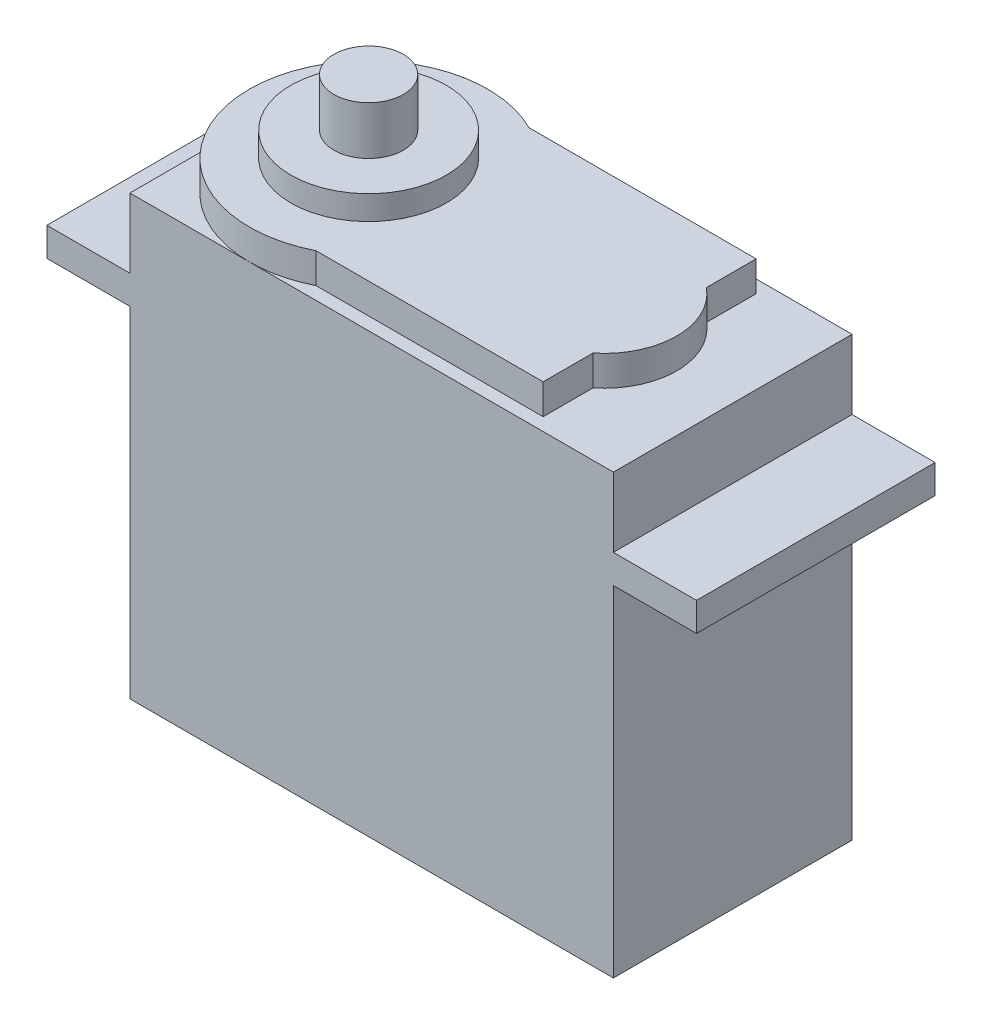
ISO-10303-21;
HEADER;
FILE_DESCRIPTION(('STEP AP214'),'2;1');
FILE_NAME('part.step','',(''),(''),'','','');
FILE_SCHEMA(('AUTOMOTIVE_DESIGN { 1 0 10303 214 1 1 1 1 }'));
ENDSEC;
DATA;
#1=APPLICATION_CONTEXT('core data for automotive mechanical design processes');
#2=APPLICATION_PROTOCOL_DEFINITION('international standard','automotive_design',2000,#1);
#3=PRODUCT_CONTEXT('',#1,'mechanical');
#4=PRODUCT('Part','Part','',(#3));
#5=PRODUCT_RELATED_PRODUCT_CATEGORY('part','',(#4));
#6=PRODUCT_DEFINITION_FORMATION('','',#4);
#7=PRODUCT_DEFINITION_CONTEXT('part definition',#1,'design');
#8=PRODUCT_DEFINITION('design','',#6,#7);
#9=PRODUCT_DEFINITION_SHAPE('','',#8);
#10=(LENGTH_UNIT() NAMED_UNIT(*) SI_UNIT(.MILLI.,.METRE.));
#11=(NAMED_UNIT(*) PLANE_ANGLE_UNIT() SI_UNIT($,.RADIAN.));
#12=(NAMED_UNIT(*) SI_UNIT($,.STERADIAN.) SOLID_ANGLE_UNIT());
#13=UNCERTAINTY_MEASURE_WITH_UNIT(LENGTH_MEASURE(1.E-05),#10,'distance_accuracy_value','');
#14=(GEOMETRIC_REPRESENTATION_CONTEXT(3) GLOBAL_UNCERTAINTY_ASSIGNED_CONTEXT((#13)) GLOBAL_UNIT_ASSIGNED_CONTEXT((#10,
#11,#12)) REPRESENTATION_CONTEXT('',''));
#15=CARTESIAN_POINT('',(0.,0.,0.));
#16=DIRECTION('',(0.,0.,1.));
#17=DIRECTION('',(1.,0.,0.));
#18=AXIS2_PLACEMENT_3D('',#15,#16,#17);
#19=CARTESIAN_POINT('',(0.,36.83,20.066));
#20=DIRECTION('',(0.,-1.,0.));
#21=DIRECTION('',(0.,0.,-1.));
#22=AXIS2_PLACEMENT_3D('',#19,#20,#21);
#23=PLANE('',#22);
#24=CARTESIAN_POINT('',(10.033,36.83,10.033));
#25=DIRECTION('',(0.,1.,0.));
#26=DIRECTION('',(0.,0.,1.));
#27=AXIS2_PLACEMENT_3D('',#24,#25,#26);
#28=CIRCLE('',#27,10.033);
#29=CARTESIAN_POINT('',(14.5602427315089,36.83,1.07950000000001));
#30=VERTEX_POINT('',#29);
#31=CARTESIAN_POINT('',(10.033,36.83,0.));
#32=VERTEX_POINT('',#31);
#33=EDGE_CURVE('E61',#30,#32,#28,.T.);
#34=ORIENTED_EDGE('',*,*,#33,.F.);
#35=DIRECTION('',(-1.,0.,0.));
#36=VECTOR('',#35,1.);
#37=CARTESIAN_POINT('',(14.5602427315089,36.83,1.07950000000001));
#38=LINE('',#37,#36);
#39=CARTESIAN_POINT('',(33.655,36.83,1.07950000000001));
#40=VERTEX_POINT('',#39);
#41=EDGE_CURVE('E65',#40,#30,#38,.T.);
#42=ORIENTED_EDGE('',*,*,#41,.F.);
#43=DIRECTION('',(0.,0.,-1.));
#44=VECTOR('',#43,1.);
#45=CARTESIAN_POINT('',(33.655,36.83,1.07950000000001));
#46=LINE('',#45,#44);
#47=CARTESIAN_POINT('',(33.655,36.83,5.2705));
#48=VERTEX_POINT('',#47);
#49=EDGE_CURVE('E401',#48,#40,#46,.T.);
#50=ORIENTED_EDGE('',*,*,#49,.F.);
#51=CARTESIAN_POINT('',(29.8370625,36.83,10.033));
#52=DIRECTION('',(0.,1.,0.));
#53=DIRECTION('',(0.,0.,-1.));
#54=AXIS2_PLACEMENT_3D('',#51,#52,#53);
#55=CIRCLE('',#54,6.10393750000001);
#56=CARTESIAN_POINT('',(33.655,36.83,14.7955));
#57=VERTEX_POINT('',#56);
#58=EDGE_CURVE('E394',#57,#48,#55,.T.);
#59=ORIENTED_EDGE('',*,*,#58,.F.);
#60=DIRECTION('',(0.,0.,-1.));
#61=VECTOR('',#60,1.);
#62=CARTESIAN_POINT('',(33.655,36.83,14.7955));
#63=LINE('',#62,#61);
#64=CARTESIAN_POINT('',(33.655,36.83,18.9865));
#65=VERTEX_POINT('',#64);
#66=EDGE_CURVE('E354',#65,#57,#63,.T.);
#67=ORIENTED_EDGE('',*,*,#66,.F.);
#68=DIRECTION('',(1.,0.,0.));
#69=VECTOR('',#68,1.);
#70=CARTESIAN_POINT('',(14.5602427315089,36.83,18.9865));
#71=LINE('',#70,#69);
#72=CARTESIAN_POINT('',(14.5602427315089,36.83,18.9865));
#73=VERTEX_POINT('',#72);
#74=EDGE_CURVE('E349',#73,#65,#71,.T.);
#75=ORIENTED_EDGE('',*,*,#74,.F.);
#76=CARTESIAN_POINT('',(10.033,36.83,20.066));
#77=VERTEX_POINT('',#76);
#78=EDGE_CURVE('E205',#77,#73,#28,.T.);
#79=ORIENTED_EDGE('',*,*,#78,.F.);
#80=DIRECTION('',(-1.,0.,0.));
#81=VECTOR('',#80,1.);
#82=CARTESIAN_POINT('',(0.,36.83,20.066));
#83=LINE('',#82,#81);
#84=CARTESIAN_POINT('',(40.64,36.83,20.066));
#85=VERTEX_POINT('',#84);
#86=EDGE_CURVE('E242',#85,#77,#83,.T.);
#87=ORIENTED_EDGE('',*,*,#86,.F.);
#88=DIRECTION('',(0.,0.,-1.));
#89=VECTOR('',#88,1.);
#90=CARTESIAN_POINT('',(40.64,36.83,20.066));
#91=LINE('',#90,#89);
#92=CARTESIAN_POINT('',(40.64,36.83,0.));
#93=VERTEX_POINT('',#92);
#94=EDGE_CURVE('E311',#85,#93,#91,.T.);
#95=ORIENTED_EDGE('',*,*,#94,.T.);
#96=DIRECTION('',(-1.,0.,0.));
#97=VECTOR('',#96,1.);
#98=CARTESIAN_POINT('',(0.,36.83,0.));
#99=LINE('',#98,#97);
#100=EDGE_CURVE('E277',#93,#32,#99,.T.);
#101=ORIENTED_EDGE('',*,*,#100,.T.);
#102=EDGE_LOOP('',(#34,#42,#50,#59,#67,#75,#79,#87,#95,#101));
#103=FACE_BOUND('',#102,.T.);
#104=ADVANCED_FACE('F43',(#103),#23,.F.);
#105=CARTESIAN_POINT('',(0.,36.83,10.033));
#106=VERTEX_POINT('',#105);
#107=EDGE_CURVE('E345',#32,#106,#28,.T.);
#108=ORIENTED_EDGE('',*,*,#107,.F.);
#109=CARTESIAN_POINT('',(0.,36.83,0.));
#110=VERTEX_POINT('',#109);
#111=EDGE_CURVE('E276',#32,#110,#99,.T.);
#112=ORIENTED_EDGE('',*,*,#111,.T.);
#113=DIRECTION('',(0.,0.,-1.));
#114=VECTOR('',#113,1.);
#115=CARTESIAN_POINT('',(0.,36.83,20.066));
#116=LINE('',#115,#114);
#117=EDGE_CURVE('E306',#106,#110,#116,.T.);
#118=ORIENTED_EDGE('',*,*,#117,.F.);
#119=EDGE_LOOP('',(#108,#112,#118));
#120=FACE_BOUND('',#119,.T.);
#121=ADVANCED_FACE('F420',(#120),#23,.F.);
#122=EDGE_CURVE('E342',#106,#77,#28,.T.);
#123=ORIENTED_EDGE('',*,*,#122,.F.);
#124=CARTESIAN_POINT('',(0.,36.83,20.066));
#125=VERTEX_POINT('',#124);
#126=EDGE_CURVE('E307',#125,#106,#116,.T.);
#127=ORIENTED_EDGE('',*,*,#126,.F.);
#128=EDGE_CURVE('E241',#77,#125,#83,.T.);
#129=ORIENTED_EDGE('',*,*,#128,.F.);
#130=EDGE_LOOP('',(#123,#127,#129));
#131=FACE_BOUND('',#130,.T.);
#132=ADVANCED_FACE('F422',(#131),#23,.F.);
#133=CARTESIAN_POINT('',(0.,0.,20.066));
#134=DIRECTION('',(1.,0.,0.));
#135=DIRECTION('',(0.,0.,-1.));
#136=AXIS2_PLACEMENT_3D('',#133,#134,#135);
#137=PLANE('',#136);
#138=DIRECTION('',(0.,-1.,0.));
#139=VECTOR('',#138,1.);
#140=CARTESIAN_POINT('',(0.,0.,0.));
#141=LINE('',#140,#139);
#142=CARTESIAN_POINT('',(0.,28.575,0.));
#143=VERTEX_POINT('',#142);
#144=CARTESIAN_POINT('',(0.,0.,0.));
#145=VERTEX_POINT('',#144);
#146=EDGE_CURVE('E207',#143,#145,#141,.T.);
#147=ORIENTED_EDGE('',*,*,#146,.T.);
#148=DIRECTION('',(0.,0.,-1.));
#149=VECTOR('',#148,1.);
#150=CARTESIAN_POINT('',(0.,0.,20.066));
#151=LINE('',#150,#149);
#152=CARTESIAN_POINT('',(0.,0.,20.066));
#153=VERTEX_POINT('',#152);
#154=EDGE_CURVE('E47',#153,#145,#151,.T.);
#155=ORIENTED_EDGE('',*,*,#154,.F.);
#156=DIRECTION('',(0.,-1.,0.));
#157=VECTOR('',#156,1.);
#158=CARTESIAN_POINT('',(0.,0.,20.066));
#159=LINE('',#158,#157);
#160=CARTESIAN_POINT('',(0.,28.575,20.066));
#161=VERTEX_POINT('',#160);
#162=EDGE_CURVE('E218',#161,#153,#159,.T.);
#163=ORIENTED_EDGE('',*,*,#162,.F.);
#164=DIRECTION('',(0.,0.,-1.));
#165=VECTOR('',#164,1.);
#166=CARTESIAN_POINT('',(0.,28.575,20.066));
#167=LINE('',#166,#165);
#168=EDGE_CURVE('E257',#161,#143,#167,.T.);
#169=ORIENTED_EDGE('',*,*,#168,.T.);
#170=EDGE_LOOP('',(#147,#155,#163,#169));
#171=FACE_BOUND('',#170,.T.);
#172=ADVANCED_FACE('F45',(#171),#137,.F.);
#173=CARTESIAN_POINT('',(0.,0.,20.066));
#174=DIRECTION('',(0.,1.,0.));
#175=DIRECTION('',(0.,0.,1.));
#176=AXIS2_PLACEMENT_3D('',#173,#174,#175);
#177=PLANE('',#176);
#178=DIRECTION('',(1.,0.,0.));
#179=VECTOR('',#178,1.);
#180=CARTESIAN_POINT('',(0.,0.,0.));
#181=LINE('',#180,#179);
#182=CARTESIAN_POINT('',(40.64,0.,0.));
#183=VERTEX_POINT('',#182);
#184=EDGE_CURVE('E212',#145,#183,#181,.T.);
#185=ORIENTED_EDGE('',*,*,#184,.T.);
#186=DIRECTION('',(0.,0.,-1.));
#187=VECTOR('',#186,1.);
#188=CARTESIAN_POINT('',(40.64,0.,20.066));
#189=LINE('',#188,#187);
#190=CARTESIAN_POINT('',(40.64,0.,20.066));
#191=VERTEX_POINT('',#190);
#192=EDGE_CURVE('E330',#191,#183,#189,.T.);
#193=ORIENTED_EDGE('',*,*,#192,.F.);
#194=DIRECTION('',(1.,0.,0.));
#195=VECTOR('',#194,1.);
#196=CARTESIAN_POINT('',(0.,0.,20.066));
#197=LINE('',#196,#195);
#198=EDGE_CURVE('E222',#153,#191,#197,.T.);
#199=ORIENTED_EDGE('',*,*,#198,.F.);
#200=ORIENTED_EDGE('',*,*,#154,.T.);
#201=EDGE_LOOP('',(#185,#193,#199,#200));
#202=FACE_BOUND('',#201,.T.);
#203=ADVANCED_FACE('F434',(#202),#177,.F.);
#204=CARTESIAN_POINT('',(40.64,0.,20.066));
#205=DIRECTION('',(-1.,0.,0.));
#206=DIRECTION('',(0.,0.,1.));
#207=AXIS2_PLACEMENT_3D('',#204,#205,#206);
#208=PLANE('',#207);
#209=DIRECTION('',(0.,1.,0.));
#210=VECTOR('',#209,1.);
#211=CARTESIAN_POINT('',(40.64,0.,0.));
#212=LINE('',#211,#210);
#213=CARTESIAN_POINT('',(40.64,28.575,0.));
#214=VERTEX_POINT('',#213);
#215=EDGE_CURVE('E261',#183,#214,#212,.T.);
#216=ORIENTED_EDGE('',*,*,#215,.T.);
#217=DIRECTION('',(0.,0.,-1.));
#218=VECTOR('',#217,1.);
#219=CARTESIAN_POINT('',(40.64,28.575,20.066));
#220=LINE('',#219,#218);
#221=CARTESIAN_POINT('',(40.64,28.575,20.066));
#222=VERTEX_POINT('',#221);
#223=EDGE_CURVE('E327',#222,#214,#220,.T.);
#224=ORIENTED_EDGE('',*,*,#223,.F.);
#225=DIRECTION('',(0.,1.,0.));
#226=VECTOR('',#225,1.);
#227=CARTESIAN_POINT('',(40.64,0.,20.066));
#228=LINE('',#227,#226);
#229=EDGE_CURVE('E226',#191,#222,#228,.T.);
#230=ORIENTED_EDGE('',*,*,#229,.F.);
#231=ORIENTED_EDGE('',*,*,#192,.T.);
#232=EDGE_LOOP('',(#216,#224,#230,#231));
#233=FACE_BOUND('',#232,.T.);
#234=ADVANCED_FACE('F479',(#233),#208,.F.);
#235=CARTESIAN_POINT('',(40.64,28.575,20.066));
#236=DIRECTION('',(0.,1.,0.));
#237=DIRECTION('',(-1.,0.,0.));
#238=AXIS2_PLACEMENT_3D('',#235,#236,#237);
#239=PLANE('',#238);
#240=DIRECTION('',(1.,0.,0.));
#241=VECTOR('',#240,1.);
#242=CARTESIAN_POINT('',(40.64,28.575,0.));
#243=LINE('',#242,#241);
#244=CARTESIAN_POINT('',(47.625,28.575,0.));
#245=VERTEX_POINT('',#244);
#246=EDGE_CURVE('E264',#214,#245,#243,.T.);
#247=ORIENTED_EDGE('',*,*,#246,.T.);
#248=DIRECTION('',(0.,0.,-1.));
#249=VECTOR('',#248,1.);
#250=CARTESIAN_POINT('',(47.625,28.575,20.066));
#251=LINE('',#250,#249);
#252=CARTESIAN_POINT('',(47.625,28.575,20.066));
#253=VERTEX_POINT('',#252);
#254=EDGE_CURVE('E323',#253,#245,#251,.T.);
#255=ORIENTED_EDGE('',*,*,#254,.F.);
#256=DIRECTION('',(1.,0.,0.));
#257=VECTOR('',#256,1.);
#258=CARTESIAN_POINT('',(40.64,28.575,20.066));
#259=LINE('',#258,#257);
#260=EDGE_CURVE('E229',#222,#253,#259,.T.);
#261=ORIENTED_EDGE('',*,*,#260,.F.);
#262=ORIENTED_EDGE('',*,*,#223,.T.);
#263=EDGE_LOOP('',(#247,#255,#261,#262));
#264=FACE_BOUND('',#263,.T.);
#265=ADVANCED_FACE('F485',(#264),#239,.F.);
#266=CARTESIAN_POINT('',(47.625,30.988,20.066));
#267=DIRECTION('',(-1.,0.,0.));
#268=DIRECTION('',(0.,0.,1.));
#269=AXIS2_PLACEMENT_3D('',#266,#267,#268);
#270=PLANE('',#269);
#271=DIRECTION('',(0.,1.,0.));
#272=VECTOR('',#271,1.);
#273=CARTESIAN_POINT('',(47.625,30.988,0.));
#274=LINE('',#273,#272);
#275=CARTESIAN_POINT('',(47.625,30.988,0.));
#276=VERTEX_POINT('',#275);
#277=EDGE_CURVE('E267',#245,#276,#274,.T.);
#278=ORIENTED_EDGE('',*,*,#277,.T.);
#279=DIRECTION('',(0.,0.,-1.));
#280=VECTOR('',#279,1.);
#281=CARTESIAN_POINT('',(47.625,30.988,20.066));
#282=LINE('',#281,#280);
#283=CARTESIAN_POINT('',(47.625,30.988,20.066));
#284=VERTEX_POINT('',#283);
#285=EDGE_CURVE('E319',#284,#276,#282,.T.);
#286=ORIENTED_EDGE('',*,*,#285,.F.);
#287=DIRECTION('',(0.,1.,0.));
#288=VECTOR('',#287,1.);
#289=CARTESIAN_POINT('',(47.625,30.988,20.066));
#290=LINE('',#289,#288);
#291=EDGE_CURVE('E232',#253,#284,#290,.T.);
#292=ORIENTED_EDGE('',*,*,#291,.F.);
#293=ORIENTED_EDGE('',*,*,#254,.T.);
#294=EDGE_LOOP('',(#278,#286,#292,#293));
#295=FACE_BOUND('',#294,.T.);
#296=ADVANCED_FACE('F488',(#295),#270,.F.);
#297=CARTESIAN_POINT('',(40.64,30.988,20.066));
#298=DIRECTION('',(0.,-1.,0.));
#299=DIRECTION('',(0.,0.,-1.));
#300=AXIS2_PLACEMENT_3D('',#297,#298,#299);
#301=PLANE('',#300);
#302=DIRECTION('',(-1.,0.,0.));
#303=VECTOR('',#302,1.);
#304=CARTESIAN_POINT('',(40.64,30.988,0.));
#305=LINE('',#304,#303);
#306=CARTESIAN_POINT('',(40.64,30.988,0.));
#307=VERTEX_POINT('',#306);
#308=EDGE_CURVE('E270',#276,#307,#305,.T.);
#309=ORIENTED_EDGE('',*,*,#308,.T.);
#310=DIRECTION('',(0.,0.,-1.));
#311=VECTOR('',#310,1.);
#312=CARTESIAN_POINT('',(40.64,30.988,20.066));
#313=LINE('',#312,#311);
#314=CARTESIAN_POINT('',(40.64,30.988,20.066));
#315=VERTEX_POINT('',#314);
#316=EDGE_CURVE('E315',#315,#307,#313,.T.);
#317=ORIENTED_EDGE('',*,*,#316,.F.);
#318=DIRECTION('',(-1.,0.,0.));
#319=VECTOR('',#318,1.);
#320=CARTESIAN_POINT('',(40.64,30.988,20.066));
#321=LINE('',#320,#319);
#322=EDGE_CURVE('E235',#284,#315,#321,.T.);
#323=ORIENTED_EDGE('',*,*,#322,.F.);
#324=ORIENTED_EDGE('',*,*,#285,.T.);
#325=EDGE_LOOP('',(#309,#317,#323,#324));
#326=FACE_BOUND('',#325,.T.);
#327=ADVANCED_FACE('F492',(#326),#301,.F.);
#328=CARTESIAN_POINT('',(40.64,30.988,20.066));
#329=DIRECTION('',(-1.,0.,0.));
#330=DIRECTION('',(0.,0.,1.));
#331=AXIS2_PLACEMENT_3D('',#328,#329,#330);
#332=PLANE('',#331);
#333=DIRECTION('',(0.,1.,0.));
#334=VECTOR('',#333,1.);
#335=CARTESIAN_POINT('',(40.64,30.988,0.));
#336=LINE('',#335,#334);
#337=EDGE_CURVE('E273',#307,#93,#336,.T.);
#338=ORIENTED_EDGE('',*,*,#337,.T.);
#339=ORIENTED_EDGE('',*,*,#94,.F.);
#340=DIRECTION('',(0.,1.,0.));
#341=VECTOR('',#340,1.);
#342=CARTESIAN_POINT('',(40.64,30.988,20.066));
#343=LINE('',#342,#341);
#344=EDGE_CURVE('E238',#315,#85,#343,.T.);
#345=ORIENTED_EDGE('',*,*,#344,.F.);
#346=ORIENTED_EDGE('',*,*,#316,.T.);
#347=EDGE_LOOP('',(#338,#339,#345,#346));
#348=FACE_BOUND('',#347,.T.);
#349=ADVANCED_FACE('F493',(#348),#332,.F.);
#350=CARTESIAN_POINT('',(0.,30.988,20.066));
#351=DIRECTION('',(1.,0.,0.));
#352=DIRECTION('',(0.,0.,-1.));
#353=AXIS2_PLACEMENT_3D('',#350,#351,#352);
#354=PLANE('',#353);
#355=DIRECTION('',(0.,-1.,0.));
#356=VECTOR('',#355,1.);
#357=CARTESIAN_POINT('',(0.,30.988,0.));
#358=LINE('',#357,#356);
#359=CARTESIAN_POINT('',(0.,30.988,0.));
#360=VERTEX_POINT('',#359);
#361=EDGE_CURVE('E280',#110,#360,#358,.T.);
#362=ORIENTED_EDGE('',*,*,#361,.T.);
#363=DIRECTION('',(0.,0.,-1.));
#364=VECTOR('',#363,1.);
#365=CARTESIAN_POINT('',(0.,30.988,20.066));
#366=LINE('',#365,#364);
#367=CARTESIAN_POINT('',(0.,30.988,20.066));
#368=VERTEX_POINT('',#367);
#369=EDGE_CURVE('E302',#368,#360,#366,.T.);
#370=ORIENTED_EDGE('',*,*,#369,.F.);
#371=DIRECTION('',(0.,-1.,0.));
#372=VECTOR('',#371,1.);
#373=CARTESIAN_POINT('',(0.,30.988,20.066));
#374=LINE('',#373,#372);
#375=EDGE_CURVE('E246',#125,#368,#374,.T.);
#376=ORIENTED_EDGE('',*,*,#375,.F.);
#377=ORIENTED_EDGE('',*,*,#126,.T.);
#378=ORIENTED_EDGE('',*,*,#117,.T.);
#379=EDGE_LOOP('',(#362,#370,#376,#377,#378));
#380=FACE_BOUND('',#379,.T.);
#381=ADVANCED_FACE('F445',(#380),#354,.F.);
#382=CARTESIAN_POINT('',(0.,30.988,20.066));
#383=DIRECTION('',(0.,-1.,0.));
#384=DIRECTION('',(0.,0.,-1.));
#385=AXIS2_PLACEMENT_3D('',#382,#383,#384);
#386=PLANE('',#385);
#387=DIRECTION('',(-1.,0.,0.));
#388=VECTOR('',#387,1.);
#389=CARTESIAN_POINT('',(0.,30.988,0.));
#390=LINE('',#389,#388);
#391=CARTESIAN_POINT('',(-6.985,30.988,0.));
#392=VERTEX_POINT('',#391);
#393=EDGE_CURVE('E283',#360,#392,#390,.T.);
#394=ORIENTED_EDGE('',*,*,#393,.T.);
#395=DIRECTION('',(0.,0.,-1.));
#396=VECTOR('',#395,1.);
#397=CARTESIAN_POINT('',(-6.985,30.988,20.066));
#398=LINE('',#397,#396);
#399=CARTESIAN_POINT('',(-6.985,30.988,20.066));
#400=VERTEX_POINT('',#399);
#401=EDGE_CURVE('E298',#400,#392,#398,.T.);
#402=ORIENTED_EDGE('',*,*,#401,.F.);
#403=DIRECTION('',(-1.,0.,0.));
#404=VECTOR('',#403,1.);
#405=CARTESIAN_POINT('',(0.,30.988,20.066));
#406=LINE('',#405,#404);
#407=EDGE_CURVE('E249',#368,#400,#406,.T.);
#408=ORIENTED_EDGE('',*,*,#407,.F.);
#409=ORIENTED_EDGE('',*,*,#369,.T.);
#410=EDGE_LOOP('',(#394,#402,#408,#409));
#411=FACE_BOUND('',#410,.T.);
#412=ADVANCED_FACE('F466',(#411),#386,.F.);
#413=CARTESIAN_POINT('',(-6.985,30.988,20.066));
#414=DIRECTION('',(1.,0.,0.));
#415=DIRECTION('',(0.,0.,-1.));
#416=AXIS2_PLACEMENT_3D('',#413,#414,#415);
#417=PLANE('',#416);
#418=DIRECTION('',(0.,-1.,0.));
#419=VECTOR('',#418,1.);
#420=CARTESIAN_POINT('',(-6.985,30.988,0.));
#421=LINE('',#420,#419);
#422=CARTESIAN_POINT('',(-6.985,28.575,0.));
#423=VERTEX_POINT('',#422);
#424=EDGE_CURVE('E286',#392,#423,#421,.T.);
#425=ORIENTED_EDGE('',*,*,#424,.T.);
#426=DIRECTION('',(0.,0.,-1.));
#427=VECTOR('',#426,1.);
#428=CARTESIAN_POINT('',(-6.985,28.575,20.066));
#429=LINE('',#428,#427);
#430=CARTESIAN_POINT('',(-6.985,28.575,20.066));
#431=VERTEX_POINT('',#430);
#432=EDGE_CURVE('E294',#431,#423,#429,.T.);
#433=ORIENTED_EDGE('',*,*,#432,.F.);
#434=DIRECTION('',(0.,-1.,0.));
#435=VECTOR('',#434,1.);
#436=CARTESIAN_POINT('',(-6.985,30.988,20.066));
#437=LINE('',#436,#435);
#438=EDGE_CURVE('E252',#400,#431,#437,.T.);
#439=ORIENTED_EDGE('',*,*,#438,.F.);
#440=ORIENTED_EDGE('',*,*,#401,.T.);
#441=EDGE_LOOP('',(#425,#433,#439,#440));
#442=FACE_BOUND('',#441,.T.);
#443=ADVANCED_FACE('F470',(#442),#417,.F.);
#444=CARTESIAN_POINT('',(0.,28.575,20.066));
#445=DIRECTION('',(0.,1.,0.));
#446=DIRECTION('',(-1.,0.,0.));
#447=AXIS2_PLACEMENT_3D('',#444,#445,#446);
#448=PLANE('',#447);
#449=DIRECTION('',(1.,0.,0.));
#450=VECTOR('',#449,1.);
#451=CARTESIAN_POINT('',(0.,28.575,0.));
#452=LINE('',#451,#450);
#453=EDGE_CURVE('E223',#423,#143,#452,.T.);
#454=ORIENTED_EDGE('',*,*,#453,.T.);
#455=ORIENTED_EDGE('',*,*,#168,.F.);
#456=DIRECTION('',(1.,0.,0.));
#457=VECTOR('',#456,1.);
#458=CARTESIAN_POINT('',(0.,28.575,20.066));
#459=LINE('',#458,#457);
#460=EDGE_CURVE('E255',#431,#161,#459,.T.);
#461=ORIENTED_EDGE('',*,*,#460,.F.);
#462=ORIENTED_EDGE('',*,*,#432,.T.);
#463=EDGE_LOOP('',(#454,#455,#461,#462));
#464=FACE_BOUND('',#463,.T.);
#465=ADVANCED_FACE('F475',(#464),#448,.F.);
#466=CARTESIAN_POINT('',(0.,0.,20.066));
#467=DIRECTION('',(0.,0.,1.));
#468=DIRECTION('',(1.,0.,0.));
#469=AXIS2_PLACEMENT_3D('',#466,#467,#468);
#470=PLANE('',#469);
#471=ORIENTED_EDGE('',*,*,#162,.T.);
#472=ORIENTED_EDGE('',*,*,#198,.T.);
#473=ORIENTED_EDGE('',*,*,#229,.T.);
#474=ORIENTED_EDGE('',*,*,#260,.T.);
#475=ORIENTED_EDGE('',*,*,#291,.T.);
#476=ORIENTED_EDGE('',*,*,#322,.T.);
#477=ORIENTED_EDGE('',*,*,#344,.T.);
#478=ORIENTED_EDGE('',*,*,#86,.T.);
#479=ORIENTED_EDGE('',*,*,#128,.T.);
#480=ORIENTED_EDGE('',*,*,#375,.T.);
#481=ORIENTED_EDGE('',*,*,#407,.T.);
#482=ORIENTED_EDGE('',*,*,#438,.T.);
#483=ORIENTED_EDGE('',*,*,#460,.T.);
#484=EDGE_LOOP('',(#471,#472,#473,#474,#475,#476,#477,#478,#479,#480,#481,#482,#483));
#485=FACE_BOUND('',#484,.T.);
#486=ADVANCED_FACE('F449',(#485),#470,.T.);
#487=CARTESIAN_POINT('',(0.,0.,0.));
#488=DIRECTION('',(0.,0.,1.));
#489=DIRECTION('',(1.,0.,0.));
#490=AXIS2_PLACEMENT_3D('',#487,#488,#489);
#491=PLANE('',#490);
#492=ORIENTED_EDGE('',*,*,#146,.F.);
#493=ORIENTED_EDGE('',*,*,#453,.F.);
#494=ORIENTED_EDGE('',*,*,#424,.F.);
#495=ORIENTED_EDGE('',*,*,#393,.F.);
#496=ORIENTED_EDGE('',*,*,#361,.F.);
#497=ORIENTED_EDGE('',*,*,#111,.F.);
#498=ORIENTED_EDGE('',*,*,#100,.F.);
#499=ORIENTED_EDGE('',*,*,#337,.F.);
#500=ORIENTED_EDGE('',*,*,#308,.F.);
#501=ORIENTED_EDGE('',*,*,#277,.F.);
#502=ORIENTED_EDGE('',*,*,#246,.F.);
#503=ORIENTED_EDGE('',*,*,#215,.F.);
#504=ORIENTED_EDGE('',*,*,#184,.F.);
#505=EDGE_LOOP('',(#492,#493,#494,#495,#496,#497,#498,#499,#500,#501,#502,#503,#504));
#506=FACE_BOUND('',#505,.T.);
#507=ADVANCED_FACE('F461',(#506),#491,.F.);
#508=CARTESIAN_POINT('',(10.033,39.37,10.033));
#509=DIRECTION('',(0.,-1.,0.));
#510=DIRECTION('',(0.,0.,-1.));
#511=AXIS2_PLACEMENT_3D('',#508,#509,#510);
#512=CYLINDRICAL_SURFACE('',#511,10.033);
#513=ORIENTED_EDGE('',*,*,#33,.T.);
#514=ORIENTED_EDGE('',*,*,#107,.T.);
#515=ORIENTED_EDGE('',*,*,#122,.T.);
#516=ORIENTED_EDGE('',*,*,#78,.T.);
#517=DIRECTION('',(0.,-1.,0.));
#518=VECTOR('',#517,1.);
#519=CARTESIAN_POINT('',(14.5602427315089,39.37,18.9865));
#520=LINE('',#519,#518);
#521=CARTESIAN_POINT('',(14.5602427315089,39.37,18.9865));
#522=VERTEX_POINT('',#521);
#523=EDGE_CURVE('E184',#522,#73,#520,.T.);
#524=ORIENTED_EDGE('',*,*,#523,.F.);
#525=CARTESIAN_POINT('',(10.033,39.37,10.033));
#526=DIRECTION('',(0.,1.,0.));
#527=DIRECTION('',(0.,0.,1.));
#528=AXIS2_PLACEMENT_3D('',#525,#526,#527);
#529=CIRCLE('',#528,10.033);
#530=CARTESIAN_POINT('',(14.5602427315089,39.37,1.07950000000001));
#531=VERTEX_POINT('',#530);
#532=EDGE_CURVE('E191',#531,#522,#529,.T.);
#533=ORIENTED_EDGE('',*,*,#532,.F.);
#534=DIRECTION('',(0.,-1.,0.));
#535=VECTOR('',#534,1.);
#536=CARTESIAN_POINT('',(14.5602427315089,39.37,1.07950000000001));
#537=LINE('',#536,#535);
#538=EDGE_CURVE('E373',#531,#30,#537,.T.);
#539=ORIENTED_EDGE('',*,*,#538,.T.);
#540=EDGE_LOOP('',(#513,#514,#515,#516,#524,#533,#539));
#541=FACE_BOUND('',#540,.T.);
#542=ADVANCED_FACE('F203',(#541),#512,.T.);
#543=CARTESIAN_POINT('',(14.5602427315089,39.37,18.9865));
#544=DIRECTION('',(0.,0.,-1.));
#545=DIRECTION('',(-1.,0.,0.));
#546=AXIS2_PLACEMENT_3D('',#543,#544,#545);
#547=PLANE('',#546);
#548=ORIENTED_EDGE('',*,*,#74,.T.);
#549=DIRECTION('',(0.,-1.,0.));
#550=VECTOR('',#549,1.);
#551=CARTESIAN_POINT('',(33.655,39.37,18.9865));
#552=LINE('',#551,#550);
#553=CARTESIAN_POINT('',(33.655,39.37,18.9865));
#554=VERTEX_POINT('',#553);
#555=EDGE_CURVE('E186',#554,#65,#552,.T.);
#556=ORIENTED_EDGE('',*,*,#555,.F.);
#557=DIRECTION('',(1.,0.,0.));
#558=VECTOR('',#557,1.);
#559=CARTESIAN_POINT('',(14.5602427315089,39.37,18.9865));
#560=LINE('',#559,#558);
#561=EDGE_CURVE('E179',#522,#554,#560,.T.);
#562=ORIENTED_EDGE('',*,*,#561,.F.);
#563=ORIENTED_EDGE('',*,*,#523,.T.);
#564=EDGE_LOOP('',(#548,#556,#562,#563));
#565=FACE_BOUND('',#564,.T.);
#566=ADVANCED_FACE('F182',(#565),#547,.F.);
#567=CARTESIAN_POINT('',(33.655,39.37,14.7955));
#568=DIRECTION('',(-1.,0.,0.));
#569=DIRECTION('',(0.,0.,1.));
#570=AXIS2_PLACEMENT_3D('',#567,#568,#569);
#571=PLANE('',#570);
#572=ORIENTED_EDGE('',*,*,#66,.T.);
#573=DIRECTION('',(0.,-1.,0.));
#574=VECTOR('',#573,1.);
#575=CARTESIAN_POINT('',(33.655,39.37,14.7955));
#576=LINE('',#575,#574);
#577=CARTESIAN_POINT('',(33.655,39.37,14.7955));
#578=VERTEX_POINT('',#577);
#579=EDGE_CURVE('E214',#578,#57,#576,.T.);
#580=ORIENTED_EDGE('',*,*,#579,.F.);
#581=DIRECTION('',(0.,0.,-1.));
#582=VECTOR('',#581,1.);
#583=CARTESIAN_POINT('',(33.655,39.37,14.7955));
#584=LINE('',#583,#582);
#585=EDGE_CURVE('E190',#554,#578,#584,.T.);
#586=ORIENTED_EDGE('',*,*,#585,.F.);
#587=ORIENTED_EDGE('',*,*,#555,.T.);
#588=EDGE_LOOP('',(#572,#580,#586,#587));
#589=FACE_BOUND('',#588,.T.);
#590=ADVANCED_FACE('F397',(#589),#571,.F.);
#591=CARTESIAN_POINT('',(29.8370625,39.37,10.033));
#592=DIRECTION('',(0.,-1.,0.));
#593=DIRECTION('',(0.,0.,-1.));
#594=AXIS2_PLACEMENT_3D('',#591,#592,#593);
#595=CYLINDRICAL_SURFACE('',#594,6.10393750000001);
#596=ORIENTED_EDGE('',*,*,#58,.T.);
#597=DIRECTION('',(0.,-1.,0.));
#598=VECTOR('',#597,1.);
#599=CARTESIAN_POINT('',(33.655,39.37,5.2705));
#600=LINE('',#599,#598);
#601=CARTESIAN_POINT('',(33.655,39.37,5.2705));
#602=VERTEX_POINT('',#601);
#603=EDGE_CURVE('E379',#602,#48,#600,.T.);
#604=ORIENTED_EDGE('',*,*,#603,.F.);
#605=CARTESIAN_POINT('',(29.8370625,39.37,10.033));
#606=DIRECTION('',(0.,1.,0.));
#607=DIRECTION('',(0.,0.,-1.));
#608=AXIS2_PLACEMENT_3D('',#605,#606,#607);
#609=CIRCLE('',#608,6.10393750000001);
#610=EDGE_CURVE('E367',#578,#602,#609,.T.);
#611=ORIENTED_EDGE('',*,*,#610,.F.);
#612=ORIENTED_EDGE('',*,*,#579,.T.);
#613=EDGE_LOOP('',(#596,#604,#611,#612));
#614=FACE_BOUND('',#613,.T.);
#615=ADVANCED_FACE('F392',(#614),#595,.T.);
#616=CARTESIAN_POINT('',(33.655,39.37,1.07950000000001));
#617=DIRECTION('',(-1.,0.,0.));
#618=DIRECTION('',(0.,0.,1.));
#619=AXIS2_PLACEMENT_3D('',#616,#617,#618);
#620=PLANE('',#619);
#621=ORIENTED_EDGE('',*,*,#49,.T.);
#622=DIRECTION('',(0.,-1.,0.));
#623=VECTOR('',#622,1.);
#624=CARTESIAN_POINT('',(33.655,39.37,1.07950000000001));
#625=LINE('',#624,#623);
#626=CARTESIAN_POINT('',(33.655,39.37,1.07950000000001));
#627=VERTEX_POINT('',#626);
#628=EDGE_CURVE('E375',#627,#40,#625,.T.);
#629=ORIENTED_EDGE('',*,*,#628,.F.);
#630=DIRECTION('',(0.,0.,-1.));
#631=VECTOR('',#630,1.);
#632=CARTESIAN_POINT('',(33.655,39.37,1.07950000000001));
#633=LINE('',#632,#631);
#634=EDGE_CURVE('E370',#602,#627,#633,.T.);
#635=ORIENTED_EDGE('',*,*,#634,.F.);
#636=ORIENTED_EDGE('',*,*,#603,.T.);
#637=EDGE_LOOP('',(#621,#629,#635,#636));
#638=FACE_BOUND('',#637,.T.);
#639=ADVANCED_FACE('F410',(#638),#620,.F.);
#640=CARTESIAN_POINT('',(14.5602427315089,39.37,1.07950000000001));
#641=DIRECTION('',(0.,0.,1.));
#642=DIRECTION('',(1.,0.,0.));
#643=AXIS2_PLACEMENT_3D('',#640,#641,#642);
#644=PLANE('',#643);
#645=ORIENTED_EDGE('',*,*,#41,.T.);
#646=ORIENTED_EDGE('',*,*,#538,.F.);
#647=DIRECTION('',(-1.,0.,0.));
#648=VECTOR('',#647,1.);
#649=CARTESIAN_POINT('',(14.5602427315089,39.37,1.07950000000001));
#650=LINE('',#649,#648);
#651=EDGE_CURVE('E196',#627,#531,#650,.T.);
#652=ORIENTED_EDGE('',*,*,#651,.F.);
#653=ORIENTED_EDGE('',*,*,#628,.T.);
#654=EDGE_LOOP('',(#645,#646,#652,#653));
#655=FACE_BOUND('',#654,.T.);
#656=ADVANCED_FACE('F408',(#655),#644,.F.);
#657=CARTESIAN_POINT('',(10.033,39.37,10.033));
#658=DIRECTION('',(0.,1.,0.));
#659=DIRECTION('',(0.,0.,1.));
#660=AXIS2_PLACEMENT_3D('',#657,#658,#659);
#661=PLANE('',#660);
#662=CARTESIAN_POINT('',(10.033,39.37,10.033));
#663=DIRECTION('',(0.,1.,0.));
#664=DIRECTION('',(0.,0.,1.));
#665=AXIS2_PLACEMENT_3D('',#662,#663,#664);
#666=CIRCLE('',#665,6.5405);
#667=CARTESIAN_POINT('',(10.033,39.37,16.5735));
#668=VERTEX_POINT('',#667);
#669=EDGE_CURVE('E53',#668,#668,#666,.T.);
#670=ORIENTED_EDGE('',*,*,#669,.F.);
#671=EDGE_LOOP('',(#670));
#672=FACE_BOUND('',#671,.T.);
#673=ORIENTED_EDGE('',*,*,#532,.T.);
#674=ORIENTED_EDGE('',*,*,#561,.T.);
#675=ORIENTED_EDGE('',*,*,#585,.T.);
#676=ORIENTED_EDGE('',*,*,#610,.T.);
#677=ORIENTED_EDGE('',*,*,#634,.T.);
#678=ORIENTED_EDGE('',*,*,#651,.T.);
#679=EDGE_LOOP('',(#673,#674,#675,#676,#677,#678));
#680=FACE_BOUND('',#679,.T.);
#681=ADVANCED_FACE('F194',(#672,#680),#661,.T.);
#682=CARTESIAN_POINT('',(10.033,41.402,10.033));
#683=DIRECTION('',(0.,-1.,0.));
#684=DIRECTION('',(0.,0.,-1.));
#685=AXIS2_PLACEMENT_3D('',#682,#683,#684);
#686=CYLINDRICAL_SURFACE('',#685,6.5405);
#687=CARTESIAN_POINT('',(10.033,41.402,10.033));
#688=DIRECTION('',(0.,1.,0.));
#689=DIRECTION('',(0.,0.,1.));
#690=AXIS2_PLACEMENT_3D('',#687,#688,#689);
#691=CIRCLE('',#690,6.5405);
#692=CARTESIAN_POINT('',(10.033,41.402,16.5735));
#693=VERTEX_POINT('',#692);
#694=EDGE_CURVE('E350',#693,#693,#691,.T.);
#695=ORIENTED_EDGE('',*,*,#694,.F.);
#696=EDGE_LOOP('',(#695));
#697=FACE_BOUND('',#696,.T.);
#698=ORIENTED_EDGE('',*,*,#669,.T.);
#699=EDGE_LOOP('',(#698));
#700=FACE_BOUND('',#699,.T.);
#701=ADVANCED_FACE('F654',(#697,#700),#686,.T.);
#702=CARTESIAN_POINT('',(10.033,41.402,10.033));
#703=DIRECTION('',(0.,1.,0.));
#704=DIRECTION('',(0.,0.,1.));
#705=AXIS2_PLACEMENT_3D('',#702,#703,#704);
#706=PLANE('',#705);
#707=CARTESIAN_POINT('',(10.033,41.402,10.033));
#708=DIRECTION('',(0.,1.,0.));
#709=DIRECTION('',(0.,0.,1.));
#710=AXIS2_PLACEMENT_3D('',#707,#708,#709);
#711=CIRCLE('',#710,2.921);
#712=CARTESIAN_POINT('',(10.033,41.402,12.954));
#713=VERTEX_POINT('',#712);
#714=EDGE_CURVE('E11',#713,#713,#711,.T.);
#715=ORIENTED_EDGE('',*,*,#714,.F.);
#716=EDGE_LOOP('',(#715));
#717=FACE_BOUND('',#716,.T.);
#718=ORIENTED_EDGE('',*,*,#694,.T.);
#719=EDGE_LOOP('',(#718));
#720=FACE_BOUND('',#719,.T.);
#721=ADVANCED_FACE('F665',(#717,#720),#706,.T.);
#722=CARTESIAN_POINT('',(10.033,45.466,10.033));
#723=DIRECTION('',(0.,-1.,0.));
#724=DIRECTION('',(0.,0.,-1.));
#725=AXIS2_PLACEMENT_3D('',#722,#723,#724);
#726=CYLINDRICAL_SURFACE('',#725,2.921);
#727=CARTESIAN_POINT('',(10.033,45.466,10.033));
#728=DIRECTION('',(0.,1.,0.));
#729=DIRECTION('',(0.,0.,1.));
#730=AXIS2_PLACEMENT_3D('',#727,#728,#729);
#731=CIRCLE('',#730,2.921);
#732=CARTESIAN_POINT('',(10.033,45.466,12.954));
#733=VERTEX_POINT('',#732);
#734=EDGE_CURVE('E356',#733,#733,#731,.T.);
#735=ORIENTED_EDGE('',*,*,#734,.F.);
#736=EDGE_LOOP('',(#735));
#737=FACE_BOUND('',#736,.T.);
#738=ORIENTED_EDGE('',*,*,#714,.T.);
#739=EDGE_LOOP('',(#738));
#740=FACE_BOUND('',#739,.T.);
#741=ADVANCED_FACE('F676',(#737,#740),#726,.T.);
#742=CARTESIAN_POINT('',(10.033,45.466,10.033));
#743=DIRECTION('',(0.,1.,0.));
#744=DIRECTION('',(0.,0.,1.));
#745=AXIS2_PLACEMENT_3D('',#742,#743,#744);
#746=PLANE('',#745);
#747=ORIENTED_EDGE('',*,*,#734,.T.);
#748=EDGE_LOOP('',(#747));
#749=FACE_BOUND('',#748,.T.);
#750=ADVANCED_FACE('F687',(#749),#746,.T.);
#751=CLOSED_SHELL('',(#104,#121,#132,#172,#203,#234,#265,#296,#327,#349,#381,#412,#443,#465,
#486,#507,#542,#566,#590,#615,#639,#656,#681,#701,#721,#741,#750));
#752=MANIFOLD_SOLID_BREP('B2',#751);
#753=ADVANCED_BREP_SHAPE_REPRESENTATION('',(#18,#752),#14);
#754=SHAPE_DEFINITION_REPRESENTATION(#9,#753);
ENDSEC;
END-ISO-10303-21;
